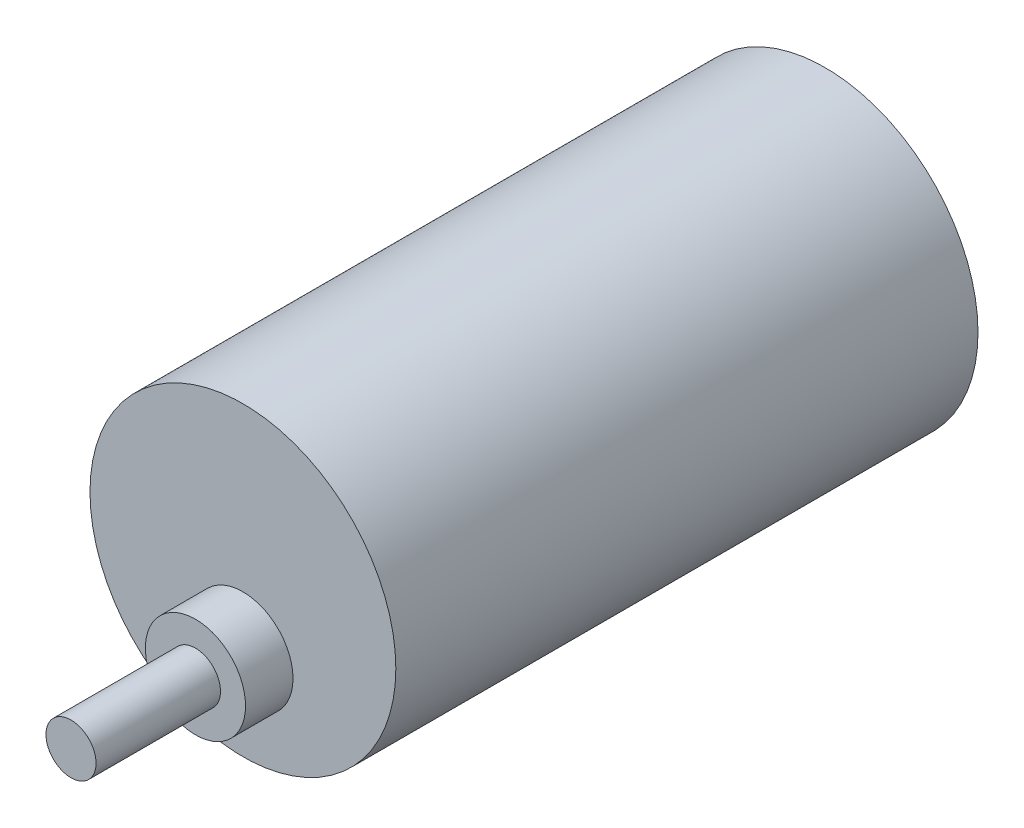
ISO-10303-21;
HEADER;
FILE_DESCRIPTION(('STEP AP214'),'2;1');
FILE_NAME('part.step','',(''),(''),'','','');
FILE_SCHEMA(('AUTOMOTIVE_DESIGN { 1 0 10303 214 1 1 1 1 }'));
ENDSEC;
DATA;
#1=APPLICATION_CONTEXT('core data for automotive mechanical design processes');
#2=APPLICATION_PROTOCOL_DEFINITION('international standard','automotive_design',2000,#1);
#3=PRODUCT_CONTEXT('',#1,'mechanical');
#4=PRODUCT('Part','Part','',(#3));
#5=PRODUCT_RELATED_PRODUCT_CATEGORY('part','',(#4));
#6=PRODUCT_DEFINITION_FORMATION('','',#4);
#7=PRODUCT_DEFINITION_CONTEXT('part definition',#1,'design');
#8=PRODUCT_DEFINITION('design','',#6,#7);
#9=PRODUCT_DEFINITION_SHAPE('','',#8);
#10=(LENGTH_UNIT() NAMED_UNIT(*) SI_UNIT(.MILLI.,.METRE.));
#11=(NAMED_UNIT(*) PLANE_ANGLE_UNIT() SI_UNIT($,.RADIAN.));
#12=(NAMED_UNIT(*) SI_UNIT($,.STERADIAN.) SOLID_ANGLE_UNIT());
#13=UNCERTAINTY_MEASURE_WITH_UNIT(LENGTH_MEASURE(1.E-05),#10,'distance_accuracy_value','');
#14=(GEOMETRIC_REPRESENTATION_CONTEXT(3) GLOBAL_UNCERTAINTY_ASSIGNED_CONTEXT((#13)) GLOBAL_UNIT_ASSIGNED_CONTEXT((#10,
#11,#12)) REPRESENTATION_CONTEXT('',''));
#15=CARTESIAN_POINT('',(0.,0.,0.));
#16=DIRECTION('',(0.,0.,1.));
#17=DIRECTION('',(1.,0.,0.));
#18=AXIS2_PLACEMENT_3D('',#15,#16,#17);
#19=CARTESIAN_POINT('',(0.,0.,70.104));
#20=DIRECTION('',(0.,0.,-1.));
#21=DIRECTION('',(-1.,0.,0.));
#22=AXIS2_PLACEMENT_3D('',#19,#20,#21);
#23=CYLINDRICAL_SURFACE('',#22,18.415);
#24=CARTESIAN_POINT('',(0.,0.,70.104));
#25=DIRECTION('',(0.,0.,1.));
#26=DIRECTION('',(1.,0.,0.));
#27=AXIS2_PLACEMENT_3D('',#24,#25,#26);
#28=CIRCLE('',#27,18.415);
#29=CARTESIAN_POINT('',(18.415,0.,70.104));
#30=VERTEX_POINT('',#29);
#31=EDGE_CURVE('E51',#30,#30,#28,.T.);
#32=ORIENTED_EDGE('',*,*,#31,.F.);
#33=EDGE_LOOP('',(#32));
#34=FACE_BOUND('',#33,.T.);
#35=CARTESIAN_POINT('',(0.,0.,0.));
#36=DIRECTION('',(0.,0.,1.));
#37=DIRECTION('',(1.,0.,0.));
#38=AXIS2_PLACEMENT_3D('',#35,#36,#37);
#39=CIRCLE('',#38,18.415);
#40=CARTESIAN_POINT('',(18.415,0.,0.));
#41=VERTEX_POINT('',#40);
#42=EDGE_CURVE('E46',#41,#41,#39,.T.);
#43=ORIENTED_EDGE('',*,*,#42,.T.);
#44=EDGE_LOOP('',(#43));
#45=FACE_BOUND('',#44,.T.);
#46=ADVANCED_FACE('F43',(#34,#45),#23,.T.);
#47=CARTESIAN_POINT('',(0.,0.,70.104));
#48=DIRECTION('',(0.,0.,1.));
#49=DIRECTION('',(1.,0.,0.));
#50=AXIS2_PLACEMENT_3D('',#47,#48,#49);
#51=PLANE('',#50);
#52=CARTESIAN_POINT('',(0.,-7.239,70.104));
#53=DIRECTION('',(0.,0.,1.));
#54=DIRECTION('',(1.,0.,0.));
#55=AXIS2_PLACEMENT_3D('',#52,#53,#54);
#56=CIRCLE('',#55,6.0325);
#57=CARTESIAN_POINT('',(6.0325,-7.239,70.104));
#58=VERTEX_POINT('',#57);
#59=EDGE_CURVE('E64',#58,#58,#56,.T.);
#60=ORIENTED_EDGE('',*,*,#59,.F.);
#61=EDGE_LOOP('',(#60));
#62=FACE_BOUND('',#61,.T.);
#63=ORIENTED_EDGE('',*,*,#31,.T.);
#64=EDGE_LOOP('',(#63));
#65=FACE_BOUND('',#64,.T.);
#66=ADVANCED_FACE('F88',(#62,#65),#51,.T.);
#67=CARTESIAN_POINT('',(0.,0.,0.));
#68=DIRECTION('',(0.,0.,1.));
#69=DIRECTION('',(1.,0.,0.));
#70=AXIS2_PLACEMENT_3D('',#67,#68,#69);
#71=PLANE('',#70);
#72=ORIENTED_EDGE('',*,*,#42,.F.);
#73=EDGE_LOOP('',(#72));
#74=FACE_BOUND('',#73,.T.);
#75=ADVANCED_FACE('F94',(#74),#71,.F.);
#76=CARTESIAN_POINT('',(0.,-7.239,75.819));
#77=DIRECTION('',(0.,0.,-1.));
#78=DIRECTION('',(-1.,0.,0.));
#79=AXIS2_PLACEMENT_3D('',#76,#77,#78);
#80=CYLINDRICAL_SURFACE('',#79,6.0325);
#81=CARTESIAN_POINT('',(0.,-7.239,75.819));
#82=DIRECTION('',(0.,0.,1.));
#83=DIRECTION('',(1.,0.,0.));
#84=AXIS2_PLACEMENT_3D('',#81,#82,#83);
#85=CIRCLE('',#84,6.0325);
#86=CARTESIAN_POINT('',(6.0325,-7.239,75.819));
#87=VERTEX_POINT('',#86);
#88=EDGE_CURVE('E60',#87,#87,#85,.T.);
#89=ORIENTED_EDGE('',*,*,#88,.F.);
#90=EDGE_LOOP('',(#89));
#91=FACE_BOUND('',#90,.T.);
#92=ORIENTED_EDGE('',*,*,#59,.T.);
#93=EDGE_LOOP('',(#92));
#94=FACE_BOUND('',#93,.T.);
#95=ADVANCED_FACE('F84',(#91,#94),#80,.T.);
#96=CARTESIAN_POINT('',(0.,-7.239,75.819));
#97=DIRECTION('',(0.,0.,1.));
#98=DIRECTION('',(1.,0.,0.));
#99=AXIS2_PLACEMENT_3D('',#96,#97,#98);
#100=PLANE('',#99);
#101=CARTESIAN_POINT('',(0.,-7.239,75.819));
#102=DIRECTION('',(0.,0.,1.));
#103=DIRECTION('',(1.,0.,0.));
#104=AXIS2_PLACEMENT_3D('',#101,#102,#103);
#105=CIRCLE('',#104,3.01625);
#106=CARTESIAN_POINT('',(3.01625,-7.239,75.819));
#107=VERTEX_POINT('',#106);
#108=EDGE_CURVE('E10',#107,#107,#105,.T.);
#109=ORIENTED_EDGE('',*,*,#108,.F.);
#110=EDGE_LOOP('',(#109));
#111=FACE_BOUND('',#110,.T.);
#112=ORIENTED_EDGE('',*,*,#88,.T.);
#113=EDGE_LOOP('',(#112));
#114=FACE_BOUND('',#113,.T.);
#115=ADVANCED_FACE('F77',(#111,#114),#100,.T.);
#116=CARTESIAN_POINT('',(0.,-7.239,90.805));
#117=DIRECTION('',(0.,0.,-1.));
#118=DIRECTION('',(-1.,0.,0.));
#119=AXIS2_PLACEMENT_3D('',#116,#117,#118);
#120=CYLINDRICAL_SURFACE('',#119,3.01625);
#121=CARTESIAN_POINT('',(0.,-7.239,90.805));
#122=DIRECTION('',(0.,0.,1.));
#123=DIRECTION('',(1.,0.,0.));
#124=AXIS2_PLACEMENT_3D('',#121,#122,#123);
#125=CIRCLE('',#124,3.01625);
#126=CARTESIAN_POINT('',(3.01625,-7.239,90.805));
#127=VERTEX_POINT('',#126);
#128=EDGE_CURVE('E59',#127,#127,#125,.T.);
#129=ORIENTED_EDGE('',*,*,#128,.F.);
#130=EDGE_LOOP('',(#129));
#131=FACE_BOUND('',#130,.T.);
#132=ORIENTED_EDGE('',*,*,#108,.T.);
#133=EDGE_LOOP('',(#132));
#134=FACE_BOUND('',#133,.T.);
#135=ADVANCED_FACE('F75',(#131,#134),#120,.T.);
#136=CARTESIAN_POINT('',(0.,-7.239,90.805));
#137=DIRECTION('',(0.,0.,1.));
#138=DIRECTION('',(1.,0.,0.));
#139=AXIS2_PLACEMENT_3D('',#136,#137,#138);
#140=PLANE('',#139);
#141=ORIENTED_EDGE('',*,*,#128,.T.);
#142=EDGE_LOOP('',(#141));
#143=FACE_BOUND('',#142,.T.);
#144=ADVANCED_FACE('F73',(#143),#140,.T.);
#145=CLOSED_SHELL('',(#46,#66,#75,#95,#115,#135,#144));
#146=MANIFOLD_SOLID_BREP('B2',#145);
#147=ADVANCED_BREP_SHAPE_REPRESENTATION('',(#18,#146),#14);
#148=SHAPE_DEFINITION_REPRESENTATION(#9,#147);
ENDSEC;
END-ISO-10303-21;
